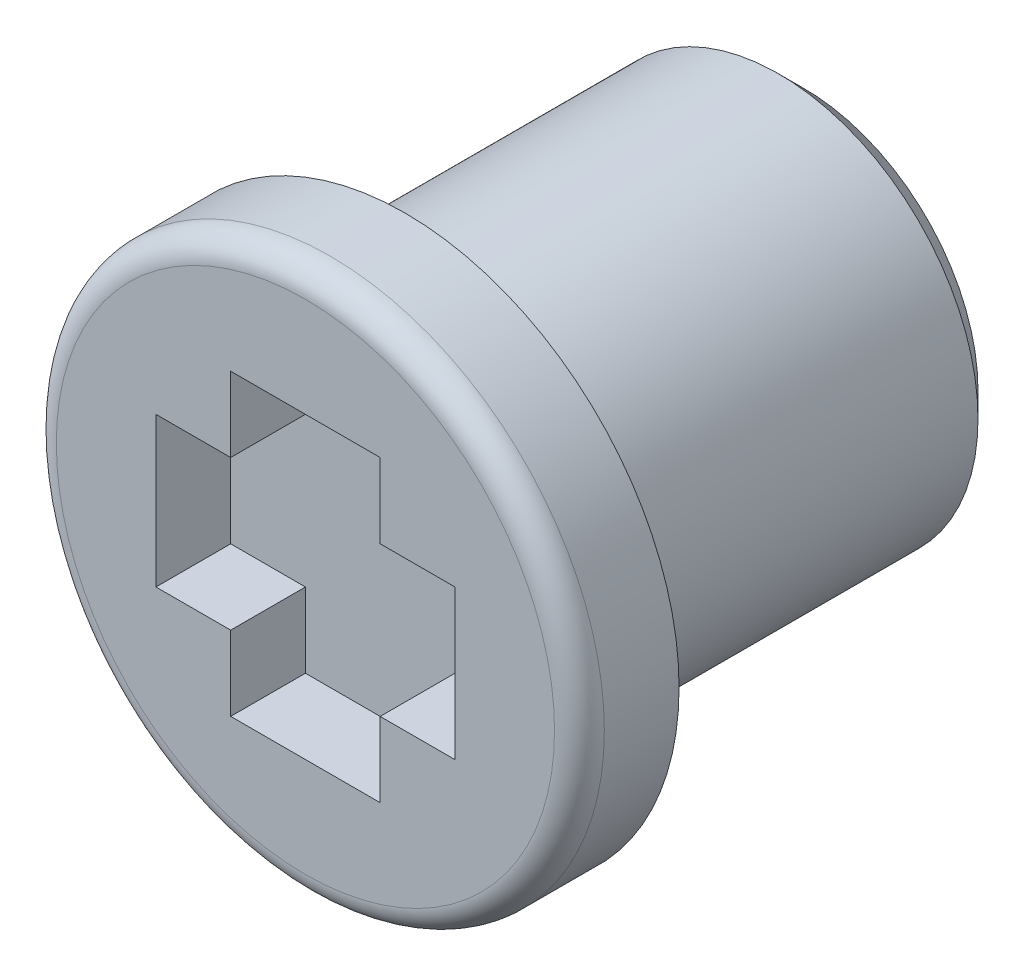
ISO-10303-21;
HEADER;
FILE_DESCRIPTION(('STEP AP214'),'2;1');
FILE_NAME('part.step','',(''),(''),'','','');
FILE_SCHEMA(('AUTOMOTIVE_DESIGN { 1 0 10303 214 1 1 1 1 }'));
ENDSEC;
DATA;
#1=APPLICATION_CONTEXT('core data for automotive mechanical design processes');
#2=APPLICATION_PROTOCOL_DEFINITION('international standard','automotive_design',2000,#1);
#3=PRODUCT_CONTEXT('',#1,'mechanical');
#4=PRODUCT('Part','Part','',(#3));
#5=PRODUCT_RELATED_PRODUCT_CATEGORY('part','',(#4));
#6=PRODUCT_DEFINITION_FORMATION('','',#4);
#7=PRODUCT_DEFINITION_CONTEXT('part definition',#1,'design');
#8=PRODUCT_DEFINITION('design','',#6,#7);
#9=PRODUCT_DEFINITION_SHAPE('','',#8);
#10=(LENGTH_UNIT() NAMED_UNIT(*) SI_UNIT(.MILLI.,.METRE.));
#11=(NAMED_UNIT(*) PLANE_ANGLE_UNIT() SI_UNIT($,.RADIAN.));
#12=(NAMED_UNIT(*) SI_UNIT($,.STERADIAN.) SOLID_ANGLE_UNIT());
#13=UNCERTAINTY_MEASURE_WITH_UNIT(LENGTH_MEASURE(1.E-05),#10,'distance_accuracy_value','');
#14=(GEOMETRIC_REPRESENTATION_CONTEXT(3) GLOBAL_UNCERTAINTY_ASSIGNED_CONTEXT((#13)) GLOBAL_UNIT_ASSIGNED_CONTEXT((#10,
#11,#12)) REPRESENTATION_CONTEXT('',''));
#15=CARTESIAN_POINT('',(0.,0.,0.));
#16=DIRECTION('',(0.,0.,1.));
#17=DIRECTION('',(1.,0.,0.));
#18=AXIS2_PLACEMENT_3D('',#15,#16,#17);
#19=CARTESIAN_POINT('',(0.,0.16943954561869,8.));
#20=DIRECTION('',(0.,0.,-1.));
#21=DIRECTION('',(-1.,0.,0.));
#22=AXIS2_PLACEMENT_3D('',#19,#20,#21);
#23=CYLINDRICAL_SURFACE('',#22,4.);
#24=CARTESIAN_POINT('',(0.,0.16943954561869,0.499999999999999));
#25=DIRECTION('',(0.,0.,1.));
#26=DIRECTION('',(1.,0.,0.));
#27=AXIS2_PLACEMENT_3D('',#24,#25,#26);
#28=CIRCLE('',#27,4.);
#29=CARTESIAN_POINT('',(4.,0.16943954561869,0.499999999999999));
#30=VERTEX_POINT('',#29);
#31=EDGE_CURVE('E247',#30,#30,#28,.T.);
#32=ORIENTED_EDGE('',*,*,#31,.T.);
#33=EDGE_LOOP('',(#32));
#34=FACE_BOUND('',#33,.T.);
#35=CARTESIAN_POINT('',(0.,0.16943954561869,8.));
#36=DIRECTION('',(0.,0.,1.));
#37=DIRECTION('',(1.,0.,0.));
#38=AXIS2_PLACEMENT_3D('',#35,#36,#37);
#39=CIRCLE('',#38,4.);
#40=CARTESIAN_POINT('',(4.,0.16943954561869,8.));
#41=VERTEX_POINT('',#40);
#42=EDGE_CURVE('E243',#41,#41,#39,.T.);
#43=ORIENTED_EDGE('',*,*,#42,.F.);
#44=EDGE_LOOP('',(#43));
#45=FACE_BOUND('',#44,.T.);
#46=ADVANCED_FACE('F41',(#34,#45),#23,.T.);
#47=CARTESIAN_POINT('',(0.,0.16943954561869,0.));
#48=DIRECTION('',(0.,0.,1.));
#49=DIRECTION('',(1.,0.,0.));
#50=AXIS2_PLACEMENT_3D('',#47,#48,#49);
#51=PLANE('',#50);
#52=CARTESIAN_POINT('',(0.,0.16943954561869,0.));
#53=DIRECTION('',(0.,0.,1.));
#54=DIRECTION('',(1.,0.,0.));
#55=AXIS2_PLACEMENT_3D('',#52,#53,#54);
#56=CIRCLE('',#55,3.5);
#57=CARTESIAN_POINT('',(3.5,0.16943954561869,0.));
#58=VERTEX_POINT('',#57);
#59=EDGE_CURVE('E251',#58,#58,#56,.F.);
#60=ORIENTED_EDGE('',*,*,#59,.T.);
#61=EDGE_LOOP('',(#60));
#62=FACE_BOUND('',#61,.T.);
#63=ADVANCED_FACE('F270',(#62),#51,.F.);
#64=CARTESIAN_POINT('',(0.,0.,10.));
#65=DIRECTION('',(0.,0.,-1.));
#66=DIRECTION('',(-1.,0.,0.));
#67=AXIS2_PLACEMENT_3D('',#64,#65,#66);
#68=CYLINDRICAL_SURFACE('',#67,5.5);
#69=CARTESIAN_POINT('',(0.,0.,9.5));
#70=DIRECTION('',(0.,0.,1.));
#71=DIRECTION('',(1.,0.,0.));
#72=AXIS2_PLACEMENT_3D('',#69,#70,#71);
#73=CIRCLE('',#72,5.5);
#74=CARTESIAN_POINT('',(5.5,0.,9.5));
#75=VERTEX_POINT('',#74);
#76=EDGE_CURVE('E11',#75,#75,#73,.F.);
#77=ORIENTED_EDGE('',*,*,#76,.T.);
#78=EDGE_LOOP('',(#77));
#79=FACE_BOUND('',#78,.T.);
#80=CARTESIAN_POINT('',(0.,0.,8.));
#81=DIRECTION('',(0.,0.,1.));
#82=DIRECTION('',(1.,0.,0.));
#83=AXIS2_PLACEMENT_3D('',#80,#81,#82);
#84=CIRCLE('',#83,5.5);
#85=CARTESIAN_POINT('',(5.5,0.,8.));
#86=VERTEX_POINT('',#85);
#87=EDGE_CURVE('E212',#86,#86,#84,.T.);
#88=ORIENTED_EDGE('',*,*,#87,.T.);
#89=EDGE_LOOP('',(#88));
#90=FACE_BOUND('',#89,.T.);
#91=ADVANCED_FACE('F276',(#79,#90),#68,.T.);
#92=CARTESIAN_POINT('',(0.,0.,10.));
#93=DIRECTION('',(0.,0.,1.));
#94=DIRECTION('',(1.,0.,0.));
#95=AXIS2_PLACEMENT_3D('',#92,#93,#94);
#96=PLANE('',#95);
#97=CARTESIAN_POINT('',(0.,0.,10.));
#98=DIRECTION('',(0.,0.,1.));
#99=DIRECTION('',(1.,0.,0.));
#100=AXIS2_PLACEMENT_3D('',#97,#98,#99);
#101=CIRCLE('',#100,5.);
#102=CARTESIAN_POINT('',(5.,0.,10.));
#103=VERTEX_POINT('',#102);
#104=EDGE_CURVE('E50',#103,#103,#101,.T.);
#105=ORIENTED_EDGE('',*,*,#104,.T.);
#106=EDGE_LOOP('',(#105));
#107=FACE_BOUND('',#106,.T.);
#108=DIRECTION('',(0.,-1.,0.));
#109=VECTOR('',#108,1.);
#110=CARTESIAN_POINT('',(-3.,0.,10.));
#111=LINE('',#110,#109);
#112=CARTESIAN_POINT('',(-3.,1.5,10.));
#113=VERTEX_POINT('',#112);
#114=CARTESIAN_POINT('',(-3.,-1.50088727006014,10.));
#115=VERTEX_POINT('',#114);
#116=EDGE_CURVE('E207',#113,#115,#111,.T.);
#117=ORIENTED_EDGE('',*,*,#116,.F.);
#118=DIRECTION('',(-1.,0.,0.));
#119=VECTOR('',#118,1.);
#120=CARTESIAN_POINT('',(-3.,1.5,10.));
#121=LINE('',#120,#119);
#122=CARTESIAN_POINT('',(-1.5,1.5,10.));
#123=VERTEX_POINT('',#122);
#124=EDGE_CURVE('E204',#123,#113,#121,.T.);
#125=ORIENTED_EDGE('',*,*,#124,.F.);
#126=DIRECTION('',(0.,-1.,0.));
#127=VECTOR('',#126,1.);
#128=CARTESIAN_POINT('',(-1.5,3.,10.));
#129=LINE('',#128,#127);
#130=CARTESIAN_POINT('',(-1.5,3.,10.));
#131=VERTEX_POINT('',#130);
#132=EDGE_CURVE('E201',#131,#123,#129,.T.);
#133=ORIENTED_EDGE('',*,*,#132,.F.);
#134=DIRECTION('',(-1.,0.,0.));
#135=VECTOR('',#134,1.);
#136=CARTESIAN_POINT('',(0.,3.,10.));
#137=LINE('',#136,#135);
#138=CARTESIAN_POINT('',(1.5,3.,10.));
#139=VERTEX_POINT('',#138);
#140=EDGE_CURVE('E151',#139,#131,#137,.T.);
#141=ORIENTED_EDGE('',*,*,#140,.F.);
#142=DIRECTION('',(0.,1.,0.));
#143=VECTOR('',#142,1.);
#144=CARTESIAN_POINT('',(1.5,3.,10.));
#145=LINE('',#144,#143);
#146=CARTESIAN_POINT('',(1.5,1.5,10.));
#147=VERTEX_POINT('',#146);
#148=EDGE_CURVE('E195',#147,#139,#145,.T.);
#149=ORIENTED_EDGE('',*,*,#148,.F.);
#150=DIRECTION('',(-1.,0.,0.));
#151=VECTOR('',#150,1.);
#152=CARTESIAN_POINT('',(1.5,1.5,10.));
#153=LINE('',#152,#151);
#154=CARTESIAN_POINT('',(3.,1.5,10.));
#155=VERTEX_POINT('',#154);
#156=EDGE_CURVE('E191',#155,#147,#153,.T.);
#157=ORIENTED_EDGE('',*,*,#156,.F.);
#158=DIRECTION('',(0.,1.,0.));
#159=VECTOR('',#158,1.);
#160=CARTESIAN_POINT('',(3.,1.5,10.));
#161=LINE('',#160,#159);
#162=CARTESIAN_POINT('',(3.,-1.50088727006014,10.));
#163=VERTEX_POINT('',#162);
#164=EDGE_CURVE('E187',#163,#155,#161,.T.);
#165=ORIENTED_EDGE('',*,*,#164,.F.);
#166=DIRECTION('',(1.,0.,0.));
#167=VECTOR('',#166,1.);
#168=CARTESIAN_POINT('',(3.,-1.50088727006014,10.));
#169=LINE('',#168,#167);
#170=CARTESIAN_POINT('',(1.5,-1.50088727006014,10.));
#171=VERTEX_POINT('',#170);
#172=EDGE_CURVE('E183',#171,#163,#169,.T.);
#173=ORIENTED_EDGE('',*,*,#172,.F.);
#174=DIRECTION('',(0.,1.,0.));
#175=VECTOR('',#174,1.);
#176=CARTESIAN_POINT('',(1.5,-1.50088727006014,10.));
#177=LINE('',#176,#175);
#178=CARTESIAN_POINT('',(1.5,-3.,10.));
#179=VERTEX_POINT('',#178);
#180=EDGE_CURVE('E179',#179,#171,#177,.T.);
#181=ORIENTED_EDGE('',*,*,#180,.F.);
#182=DIRECTION('',(1.,0.,0.));
#183=VECTOR('',#182,1.);
#184=CARTESIAN_POINT('',(-1.5,-3.,10.));
#185=LINE('',#184,#183);
#186=CARTESIAN_POINT('',(-1.5,-3.,10.));
#187=VERTEX_POINT('',#186);
#188=EDGE_CURVE('E175',#187,#179,#185,.T.);
#189=ORIENTED_EDGE('',*,*,#188,.F.);
#190=DIRECTION('',(0.,-1.,0.));
#191=VECTOR('',#190,1.);
#192=CARTESIAN_POINT('',(-1.5,-1.50088727006014,10.));
#193=LINE('',#192,#191);
#194=CARTESIAN_POINT('',(-1.5,-1.50088727006014,10.));
#195=VERTEX_POINT('',#194);
#196=EDGE_CURVE('E171',#195,#187,#193,.T.);
#197=ORIENTED_EDGE('',*,*,#196,.F.);
#198=DIRECTION('',(1.,0.,0.));
#199=VECTOR('',#198,1.);
#200=CARTESIAN_POINT('',(-3.,-1.50088727006014,10.));
#201=LINE('',#200,#199);
#202=EDGE_CURVE('E168',#115,#195,#201,.T.);
#203=ORIENTED_EDGE('',*,*,#202,.F.);
#204=EDGE_LOOP('',(#117,#125,#133,#141,#149,#157,#165,#173,#181,#189,#197,#203));
#205=FACE_BOUND('',#204,.T.);
#206=ADVANCED_FACE('F258',(#107,#205),#96,.T.);
#207=CARTESIAN_POINT('',(0.,0.,8.));
#208=DIRECTION('',(0.,0.,1.));
#209=DIRECTION('',(1.,0.,0.));
#210=AXIS2_PLACEMENT_3D('',#207,#208,#209);
#211=PLANE('',#210);
#212=ORIENTED_EDGE('',*,*,#42,.T.);
#213=EDGE_LOOP('',(#212));
#214=FACE_BOUND('',#213,.T.);
#215=ORIENTED_EDGE('',*,*,#87,.F.);
#216=EDGE_LOOP('',(#215));
#217=FACE_BOUND('',#216,.T.);
#218=ADVANCED_FACE('F287',(#214,#217),#211,.F.);
#219=CARTESIAN_POINT('',(0.,0.16943954561869,0.499999999999999));
#220=DIRECTION('',(0.,0.,1.));
#221=DIRECTION('',(1.,0.,0.));
#222=AXIS2_PLACEMENT_3D('',#219,#220,#221);
#223=CONICAL_SURFACE('',#222,4.,0.78539816339745);
#224=ORIENTED_EDGE('',*,*,#59,.F.);
#225=EDGE_LOOP('',(#224));
#226=FACE_BOUND('',#225,.T.);
#227=ORIENTED_EDGE('',*,*,#31,.F.);
#228=EDGE_LOOP('',(#227));
#229=FACE_BOUND('',#228,.T.);
#230=ADVANCED_FACE('F282',(#226,#229),#223,.T.);
#231=CARTESIAN_POINT('',(-3.,0.,8.5));
#232=DIRECTION('',(-1.,0.,0.));
#233=DIRECTION('',(0.,0.,1.));
#234=AXIS2_PLACEMENT_3D('',#231,#232,#233);
#235=PLANE('',#234);
#236=ORIENTED_EDGE('',*,*,#116,.T.);
#237=DIRECTION('',(0.,0.,1.));
#238=VECTOR('',#237,1.);
#239=CARTESIAN_POINT('',(-3.,-1.50088727006014,8.5));
#240=LINE('',#239,#238);
#241=CARTESIAN_POINT('',(-3.,-1.50088727006014,8.5));
#242=VERTEX_POINT('',#241);
#243=EDGE_CURVE('E57',#242,#115,#240,.T.);
#244=ORIENTED_EDGE('',*,*,#243,.F.);
#245=DIRECTION('',(0.,-1.,0.));
#246=VECTOR('',#245,1.);
#247=CARTESIAN_POINT('',(-3.,0.,8.5));
#248=LINE('',#247,#246);
#249=CARTESIAN_POINT('',(-3.,1.5,8.5));
#250=VERTEX_POINT('',#249);
#251=EDGE_CURVE('E65',#250,#242,#248,.T.);
#252=ORIENTED_EDGE('',*,*,#251,.F.);
#253=DIRECTION('',(0.,0.,1.));
#254=VECTOR('',#253,1.);
#255=CARTESIAN_POINT('',(-3.,1.5,8.5));
#256=LINE('',#255,#254);
#257=EDGE_CURVE('E103',#250,#113,#256,.T.);
#258=ORIENTED_EDGE('',*,*,#257,.T.);
#259=EDGE_LOOP('',(#236,#244,#252,#258));
#260=FACE_BOUND('',#259,.T.);
#261=ADVANCED_FACE('F286',(#260),#235,.F.);
#262=CARTESIAN_POINT('',(-3.,1.5,8.5));
#263=DIRECTION('',(0.,1.,0.));
#264=DIRECTION('',(0.,0.,1.));
#265=AXIS2_PLACEMENT_3D('',#262,#263,#264);
#266=PLANE('',#265);
#267=ORIENTED_EDGE('',*,*,#124,.T.);
#268=ORIENTED_EDGE('',*,*,#257,.F.);
#269=DIRECTION('',(-1.,0.,0.));
#270=VECTOR('',#269,1.);
#271=CARTESIAN_POINT('',(-3.,1.5,8.5));
#272=LINE('',#271,#270);
#273=CARTESIAN_POINT('',(-1.5,1.5,8.5));
#274=VERTEX_POINT('',#273);
#275=EDGE_CURVE('E162',#274,#250,#272,.T.);
#276=ORIENTED_EDGE('',*,*,#275,.F.);
#277=DIRECTION('',(0.,0.,1.));
#278=VECTOR('',#277,1.);
#279=CARTESIAN_POINT('',(-1.5,1.5,8.5));
#280=LINE('',#279,#278);
#281=EDGE_CURVE('E156',#274,#123,#280,.T.);
#282=ORIENTED_EDGE('',*,*,#281,.T.);
#283=EDGE_LOOP('',(#267,#268,#276,#282));
#284=FACE_BOUND('',#283,.T.);
#285=ADVANCED_FACE('F293',(#284),#266,.F.);
#286=CARTESIAN_POINT('',(-1.5,3.,8.5));
#287=DIRECTION('',(-1.,0.,0.));
#288=DIRECTION('',(0.,-1.,0.));
#289=AXIS2_PLACEMENT_3D('',#286,#287,#288);
#290=PLANE('',#289);
#291=ORIENTED_EDGE('',*,*,#132,.T.);
#292=ORIENTED_EDGE('',*,*,#281,.F.);
#293=DIRECTION('',(0.,-1.,0.));
#294=VECTOR('',#293,1.);
#295=CARTESIAN_POINT('',(-1.5,3.,8.5));
#296=LINE('',#295,#294);
#297=CARTESIAN_POINT('',(-1.5,3.,8.5));
#298=VERTEX_POINT('',#297);
#299=EDGE_CURVE('E140',#298,#274,#296,.T.);
#300=ORIENTED_EDGE('',*,*,#299,.F.);
#301=DIRECTION('',(0.,0.,1.));
#302=VECTOR('',#301,1.);
#303=CARTESIAN_POINT('',(-1.5,3.,8.5));
#304=LINE('',#303,#302);
#305=EDGE_CURVE('E148',#298,#131,#304,.T.);
#306=ORIENTED_EDGE('',*,*,#305,.T.);
#307=EDGE_LOOP('',(#291,#292,#300,#306));
#308=FACE_BOUND('',#307,.T.);
#309=ADVANCED_FACE('F159',(#308),#290,.F.);
#310=CARTESIAN_POINT('',(0.,3.,8.5));
#311=DIRECTION('',(0.,1.,0.));
#312=DIRECTION('',(0.,0.,1.));
#313=AXIS2_PLACEMENT_3D('',#310,#311,#312);
#314=PLANE('',#313);
#315=ORIENTED_EDGE('',*,*,#140,.T.);
#316=ORIENTED_EDGE('',*,*,#305,.F.);
#317=DIRECTION('',(-1.,0.,0.));
#318=VECTOR('',#317,1.);
#319=CARTESIAN_POINT('',(0.,3.,8.5));
#320=LINE('',#319,#318);
#321=CARTESIAN_POINT('',(1.5,3.,8.5));
#322=VERTEX_POINT('',#321);
#323=EDGE_CURVE('E135',#322,#298,#320,.T.);
#324=ORIENTED_EDGE('',*,*,#323,.F.);
#325=DIRECTION('',(0.,0.,1.));
#326=VECTOR('',#325,1.);
#327=CARTESIAN_POINT('',(1.5,3.,8.5));
#328=LINE('',#327,#326);
#329=EDGE_CURVE('E157',#322,#139,#328,.T.);
#330=ORIENTED_EDGE('',*,*,#329,.T.);
#331=EDGE_LOOP('',(#315,#316,#324,#330));
#332=FACE_BOUND('',#331,.T.);
#333=ADVANCED_FACE('F149',(#332),#314,.F.);
#334=CARTESIAN_POINT('',(1.5,3.,8.5));
#335=DIRECTION('',(1.,0.,0.));
#336=DIRECTION('',(0.,1.,0.));
#337=AXIS2_PLACEMENT_3D('',#334,#335,#336);
#338=PLANE('',#337);
#339=ORIENTED_EDGE('',*,*,#148,.T.);
#340=ORIENTED_EDGE('',*,*,#329,.F.);
#341=DIRECTION('',(0.,1.,0.));
#342=VECTOR('',#341,1.);
#343=CARTESIAN_POINT('',(1.5,3.,8.5));
#344=LINE('',#343,#342);
#345=CARTESIAN_POINT('',(1.5,1.5,8.5));
#346=VERTEX_POINT('',#345);
#347=EDGE_CURVE('E143',#346,#322,#344,.T.);
#348=ORIENTED_EDGE('',*,*,#347,.F.);
#349=DIRECTION('',(0.,0.,1.));
#350=VECTOR('',#349,1.);
#351=CARTESIAN_POINT('',(1.5,1.5,8.5));
#352=LINE('',#351,#350);
#353=EDGE_CURVE('E217',#346,#147,#352,.T.);
#354=ORIENTED_EDGE('',*,*,#353,.T.);
#355=EDGE_LOOP('',(#339,#340,#348,#354));
#356=FACE_BOUND('',#355,.T.);
#357=ADVANCED_FACE('F390',(#356),#338,.F.);
#358=CARTESIAN_POINT('',(1.5,1.5,8.5));
#359=DIRECTION('',(0.,1.,0.));
#360=DIRECTION('',(0.,0.,1.));
#361=AXIS2_PLACEMENT_3D('',#358,#359,#360);
#362=PLANE('',#361);
#363=ORIENTED_EDGE('',*,*,#156,.T.);
#364=ORIENTED_EDGE('',*,*,#353,.F.);
#365=DIRECTION('',(-1.,0.,0.));
#366=VECTOR('',#365,1.);
#367=CARTESIAN_POINT('',(1.5,1.5,8.5));
#368=LINE('',#367,#366);
#369=CARTESIAN_POINT('',(3.,1.5,8.5));
#370=VERTEX_POINT('',#369);
#371=EDGE_CURVE('E489',#370,#346,#368,.T.);
#372=ORIENTED_EDGE('',*,*,#371,.F.);
#373=DIRECTION('',(0.,0.,1.));
#374=VECTOR('',#373,1.);
#375=CARTESIAN_POINT('',(3.,1.5,8.5));
#376=LINE('',#375,#374);
#377=EDGE_CURVE('E220',#370,#155,#376,.T.);
#378=ORIENTED_EDGE('',*,*,#377,.T.);
#379=EDGE_LOOP('',(#363,#364,#372,#378));
#380=FACE_BOUND('',#379,.T.);
#381=ADVANCED_FACE('F381',(#380),#362,.F.);
#382=CARTESIAN_POINT('',(3.,1.5,8.5));
#383=DIRECTION('',(1.,0.,0.));
#384=DIRECTION('',(0.,0.,-1.));
#385=AXIS2_PLACEMENT_3D('',#382,#383,#384);
#386=PLANE('',#385);
#387=ORIENTED_EDGE('',*,*,#164,.T.);
#388=ORIENTED_EDGE('',*,*,#377,.F.);
#389=DIRECTION('',(0.,1.,0.));
#390=VECTOR('',#389,1.);
#391=CARTESIAN_POINT('',(3.,1.5,8.5));
#392=LINE('',#391,#390);
#393=CARTESIAN_POINT('',(3.,-1.50088727006014,8.5));
#394=VERTEX_POINT('',#393);
#395=EDGE_CURVE('E485',#394,#370,#392,.T.);
#396=ORIENTED_EDGE('',*,*,#395,.F.);
#397=DIRECTION('',(0.,0.,1.));
#398=VECTOR('',#397,1.);
#399=CARTESIAN_POINT('',(3.,-1.50088727006014,8.5));
#400=LINE('',#399,#398);
#401=EDGE_CURVE('E223',#394,#163,#400,.T.);
#402=ORIENTED_EDGE('',*,*,#401,.T.);
#403=EDGE_LOOP('',(#387,#388,#396,#402));
#404=FACE_BOUND('',#403,.T.);
#405=ADVANCED_FACE('F372',(#404),#386,.F.);
#406=CARTESIAN_POINT('',(3.,-1.50088727006014,8.5));
#407=DIRECTION('',(0.,-1.,0.));
#408=DIRECTION('',(0.,0.,-1.));
#409=AXIS2_PLACEMENT_3D('',#406,#407,#408);
#410=PLANE('',#409);
#411=ORIENTED_EDGE('',*,*,#172,.T.);
#412=ORIENTED_EDGE('',*,*,#401,.F.);
#413=DIRECTION('',(1.,0.,0.));
#414=VECTOR('',#413,1.);
#415=CARTESIAN_POINT('',(3.,-1.50088727006014,8.5));
#416=LINE('',#415,#414);
#417=CARTESIAN_POINT('',(1.5,-1.50088727006014,8.5));
#418=VERTEX_POINT('',#417);
#419=EDGE_CURVE('E481',#418,#394,#416,.T.);
#420=ORIENTED_EDGE('',*,*,#419,.F.);
#421=DIRECTION('',(0.,0.,1.));
#422=VECTOR('',#421,1.);
#423=CARTESIAN_POINT('',(1.5,-1.50088727006014,8.5));
#424=LINE('',#423,#422);
#425=EDGE_CURVE('E226',#418,#171,#424,.T.);
#426=ORIENTED_EDGE('',*,*,#425,.T.);
#427=EDGE_LOOP('',(#411,#412,#420,#426));
#428=FACE_BOUND('',#427,.T.);
#429=ADVANCED_FACE('F363',(#428),#410,.F.);
#430=CARTESIAN_POINT('',(1.5,-1.50088727006014,8.5));
#431=DIRECTION('',(1.,0.,0.));
#432=DIRECTION('',(0.,0.,-1.));
#433=AXIS2_PLACEMENT_3D('',#430,#431,#432);
#434=PLANE('',#433);
#435=ORIENTED_EDGE('',*,*,#180,.T.);
#436=ORIENTED_EDGE('',*,*,#425,.F.);
#437=DIRECTION('',(0.,1.,0.));
#438=VECTOR('',#437,1.);
#439=CARTESIAN_POINT('',(1.5,-1.50088727006014,8.5));
#440=LINE('',#439,#438);
#441=CARTESIAN_POINT('',(1.5,-3.,8.5));
#442=VERTEX_POINT('',#441);
#443=EDGE_CURVE('E477',#442,#418,#440,.T.);
#444=ORIENTED_EDGE('',*,*,#443,.F.);
#445=DIRECTION('',(0.,0.,1.));
#446=VECTOR('',#445,1.);
#447=CARTESIAN_POINT('',(1.5,-3.,8.5));
#448=LINE('',#447,#446);
#449=EDGE_CURVE('E229',#442,#179,#448,.T.);
#450=ORIENTED_EDGE('',*,*,#449,.T.);
#451=EDGE_LOOP('',(#435,#436,#444,#450));
#452=FACE_BOUND('',#451,.T.);
#453=ADVANCED_FACE('F354',(#452),#434,.F.);
#454=CARTESIAN_POINT('',(-1.5,-3.,8.5));
#455=DIRECTION('',(0.,-1.,0.));
#456=DIRECTION('',(0.,0.,-1.));
#457=AXIS2_PLACEMENT_3D('',#454,#455,#456);
#458=PLANE('',#457);
#459=ORIENTED_EDGE('',*,*,#188,.T.);
#460=ORIENTED_EDGE('',*,*,#449,.F.);
#461=DIRECTION('',(1.,0.,0.));
#462=VECTOR('',#461,1.);
#463=CARTESIAN_POINT('',(-1.5,-3.,8.5));
#464=LINE('',#463,#462);
#465=CARTESIAN_POINT('',(-1.5,-3.,8.5));
#466=VERTEX_POINT('',#465);
#467=EDGE_CURVE('E468',#466,#442,#464,.T.);
#468=ORIENTED_EDGE('',*,*,#467,.F.);
#469=DIRECTION('',(0.,0.,1.));
#470=VECTOR('',#469,1.);
#471=CARTESIAN_POINT('',(-1.5,-3.,8.5));
#472=LINE('',#471,#470);
#473=EDGE_CURVE('E232',#466,#187,#472,.T.);
#474=ORIENTED_EDGE('',*,*,#473,.T.);
#475=EDGE_LOOP('',(#459,#460,#468,#474));
#476=FACE_BOUND('',#475,.T.);
#477=ADVANCED_FACE('F345',(#476),#458,.F.);
#478=CARTESIAN_POINT('',(-1.5,-1.50088727006014,8.5));
#479=DIRECTION('',(-1.,0.,0.));
#480=DIRECTION('',(0.,-1.,0.));
#481=AXIS2_PLACEMENT_3D('',#478,#479,#480);
#482=PLANE('',#481);
#483=ORIENTED_EDGE('',*,*,#196,.T.);
#484=ORIENTED_EDGE('',*,*,#473,.F.);
#485=DIRECTION('',(0.,-1.,0.));
#486=VECTOR('',#485,1.);
#487=CARTESIAN_POINT('',(-1.5,-1.50088727006014,8.5));
#488=LINE('',#487,#486);
#489=CARTESIAN_POINT('',(-1.5,-1.50088727006014,8.5));
#490=VERTEX_POINT('',#489);
#491=EDGE_CURVE('E464',#490,#466,#488,.T.);
#492=ORIENTED_EDGE('',*,*,#491,.F.);
#493=DIRECTION('',(0.,0.,1.));
#494=VECTOR('',#493,1.);
#495=CARTESIAN_POINT('',(-1.5,-1.50088727006014,8.5));
#496=LINE('',#495,#494);
#497=EDGE_CURVE('E235',#490,#195,#496,.T.);
#498=ORIENTED_EDGE('',*,*,#497,.T.);
#499=EDGE_LOOP('',(#483,#484,#492,#498));
#500=FACE_BOUND('',#499,.T.);
#501=ADVANCED_FACE('F338',(#500),#482,.F.);
#502=CARTESIAN_POINT('',(-3.,-1.50088727006014,8.5));
#503=DIRECTION('',(0.,-1.,0.));
#504=DIRECTION('',(1.,0.,0.));
#505=AXIS2_PLACEMENT_3D('',#502,#503,#504);
#506=PLANE('',#505);
#507=ORIENTED_EDGE('',*,*,#202,.T.);
#508=ORIENTED_EDGE('',*,*,#497,.F.);
#509=DIRECTION('',(1.,0.,0.));
#510=VECTOR('',#509,1.);
#511=CARTESIAN_POINT('',(-3.,-1.50088727006014,8.5));
#512=LINE('',#511,#510);
#513=EDGE_CURVE('E462',#242,#490,#512,.T.);
#514=ORIENTED_EDGE('',*,*,#513,.F.);
#515=ORIENTED_EDGE('',*,*,#243,.T.);
#516=EDGE_LOOP('',(#507,#508,#514,#515));
#517=FACE_BOUND('',#516,.T.);
#518=ADVANCED_FACE('F266',(#517),#506,.F.);
#519=CARTESIAN_POINT('',(0.,0.,8.5));
#520=DIRECTION('',(0.,0.,1.));
#521=DIRECTION('',(1.,0.,0.));
#522=AXIS2_PLACEMENT_3D('',#519,#520,#521);
#523=PLANE('',#522);
#524=ORIENTED_EDGE('',*,*,#251,.T.);
#525=ORIENTED_EDGE('',*,*,#513,.T.);
#526=ORIENTED_EDGE('',*,*,#491,.T.);
#527=ORIENTED_EDGE('',*,*,#467,.T.);
#528=ORIENTED_EDGE('',*,*,#443,.T.);
#529=ORIENTED_EDGE('',*,*,#419,.T.);
#530=ORIENTED_EDGE('',*,*,#395,.T.);
#531=ORIENTED_EDGE('',*,*,#371,.T.);
#532=ORIENTED_EDGE('',*,*,#347,.T.);
#533=ORIENTED_EDGE('',*,*,#323,.T.);
#534=ORIENTED_EDGE('',*,*,#299,.T.);
#535=ORIENTED_EDGE('',*,*,#275,.T.);
#536=EDGE_LOOP('',(#524,#525,#526,#527,#528,#529,#530,#531,#532,#533,#534,#535));
#537=FACE_BOUND('',#536,.T.);
#538=ADVANCED_FACE('F137',(#537),#523,.T.);
#539=CARTESIAN_POINT('',(0.,0.,9.5));
#540=DIRECTION('',(0.,0.,1.));
#541=DIRECTION('',(1.,0.,0.));
#542=AXIS2_PLACEMENT_3D('',#539,#540,#541);
#543=TOROIDAL_SURFACE('',#542,5.,0.5);
#544=ORIENTED_EDGE('',*,*,#76,.F.);
#545=EDGE_LOOP('',(#544));
#546=FACE_BOUND('',#545,.T.);
#547=ORIENTED_EDGE('',*,*,#104,.F.);
#548=EDGE_LOOP('',(#547));
#549=FACE_BOUND('',#548,.T.);
#550=ADVANCED_FACE('F43',(#546,#549),#543,.T.);
#551=CLOSED_SHELL('',(#46,#63,#91,#206,#218,#230,#261,#285,#309,#333,#357,#381,#405,#429,#453,
#477,#501,#518,#538,#550));
#552=MANIFOLD_SOLID_BREP('B2',#551);
#553=ADVANCED_BREP_SHAPE_REPRESENTATION('',(#18,#552),#14);
#554=SHAPE_DEFINITION_REPRESENTATION(#9,#553);
ENDSEC;
END-ISO-10303-21;
